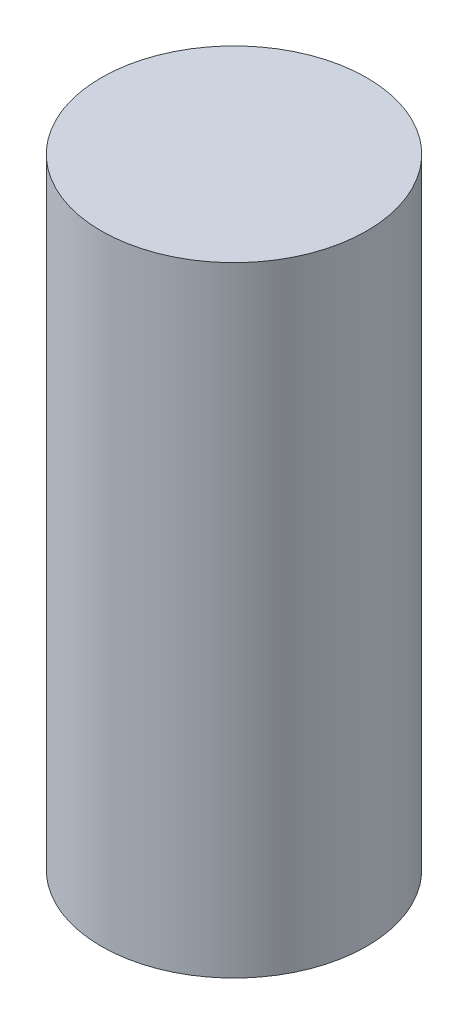
ISO-10303-21;
HEADER;
FILE_DESCRIPTION(('STEP AP214'),'2;1');
FILE_NAME('part.step','',(''),(''),'','','');
FILE_SCHEMA(('AUTOMOTIVE_DESIGN { 1 0 10303 214 1 1 1 1 }'));
ENDSEC;
DATA;
#1=APPLICATION_CONTEXT('core data for automotive mechanical design processes');
#2=APPLICATION_PROTOCOL_DEFINITION('international standard','automotive_design',2000,#1);
#3=PRODUCT_CONTEXT('',#1,'mechanical');
#4=PRODUCT('Part','Part','',(#3));
#5=PRODUCT_RELATED_PRODUCT_CATEGORY('part','',(#4));
#6=PRODUCT_DEFINITION_FORMATION('','',#4);
#7=PRODUCT_DEFINITION_CONTEXT('part definition',#1,'design');
#8=PRODUCT_DEFINITION('design','',#6,#7);
#9=PRODUCT_DEFINITION_SHAPE('','',#8);
#10=(LENGTH_UNIT() NAMED_UNIT(*) SI_UNIT(.MILLI.,.METRE.));
#11=(NAMED_UNIT(*) PLANE_ANGLE_UNIT() SI_UNIT($,.RADIAN.));
#12=(NAMED_UNIT(*) SI_UNIT($,.STERADIAN.) SOLID_ANGLE_UNIT());
#13=UNCERTAINTY_MEASURE_WITH_UNIT(LENGTH_MEASURE(1.E-05),#10,'distance_accuracy_value','');
#14=(GEOMETRIC_REPRESENTATION_CONTEXT(3) GLOBAL_UNCERTAINTY_ASSIGNED_CONTEXT((#13)) GLOBAL_UNIT_ASSIGNED_CONTEXT((#10,
#11,#12)) REPRESENTATION_CONTEXT('',''));
#15=CARTESIAN_POINT('',(0.,0.,0.));
#16=DIRECTION('',(0.,0.,1.));
#17=DIRECTION('',(1.,0.,0.));
#18=AXIS2_PLACEMENT_3D('',#15,#16,#17);
#19=CARTESIAN_POINT('',(0.,88.9,0.));
#20=DIRECTION('',(0.,-1.,0.));
#21=DIRECTION('',(0.,0.,-1.));
#22=AXIS2_PLACEMENT_3D('',#19,#20,#21);
#23=CYLINDRICAL_SURFACE('',#22,19.05);
#24=CARTESIAN_POINT('',(0.,88.9,0.));
#25=DIRECTION('',(0.,1.,0.));
#26=DIRECTION('',(0.,0.,1.));
#27=AXIS2_PLACEMENT_3D('',#24,#25,#26);
#28=CIRCLE('',#27,19.05);
#29=CARTESIAN_POINT('',(0.,88.9,19.05));
#30=VERTEX_POINT('',#29);
#31=EDGE_CURVE('E10',#30,#30,#28,.T.);
#32=ORIENTED_EDGE('',*,*,#31,.F.);
#33=EDGE_LOOP('',(#32));
#34=FACE_BOUND('',#33,.T.);
#35=CARTESIAN_POINT('',(0.,0.,0.));
#36=DIRECTION('',(0.,1.,0.));
#37=DIRECTION('',(0.,0.,1.));
#38=AXIS2_PLACEMENT_3D('',#35,#36,#37);
#39=CIRCLE('',#38,19.05);
#40=CARTESIAN_POINT('',(0.,0.,19.05));
#41=VERTEX_POINT('',#40);
#42=EDGE_CURVE('E35',#41,#41,#39,.T.);
#43=ORIENTED_EDGE('',*,*,#42,.T.);
#44=EDGE_LOOP('',(#43));
#45=FACE_BOUND('',#44,.T.);
#46=ADVANCED_FACE('F32',(#34,#45),#23,.T.);
#47=CARTESIAN_POINT('',(0.,88.9,0.));
#48=DIRECTION('',(0.,1.,0.));
#49=DIRECTION('',(0.,0.,1.));
#50=AXIS2_PLACEMENT_3D('',#47,#48,#49);
#51=PLANE('',#50);
#52=ORIENTED_EDGE('',*,*,#31,.T.);
#53=EDGE_LOOP('',(#52));
#54=FACE_BOUND('',#53,.T.);
#55=ADVANCED_FACE('F47',(#54),#51,.T.);
#56=CARTESIAN_POINT('',(0.,0.,0.));
#57=DIRECTION('',(0.,1.,0.));
#58=DIRECTION('',(0.,0.,1.));
#59=AXIS2_PLACEMENT_3D('',#56,#57,#58);
#60=PLANE('',#59);
#61=ORIENTED_EDGE('',*,*,#42,.F.);
#62=EDGE_LOOP('',(#61));
#63=FACE_BOUND('',#62,.T.);
#64=ADVANCED_FACE('F45',(#63),#60,.F.);
#65=CLOSED_SHELL('',(#46,#55,#64));
#66=MANIFOLD_SOLID_BREP('B2',#65);
#67=ADVANCED_BREP_SHAPE_REPRESENTATION('',(#18,#66),#14);
#68=SHAPE_DEFINITION_REPRESENTATION(#9,#67);
ENDSEC;
END-ISO-10303-21;
